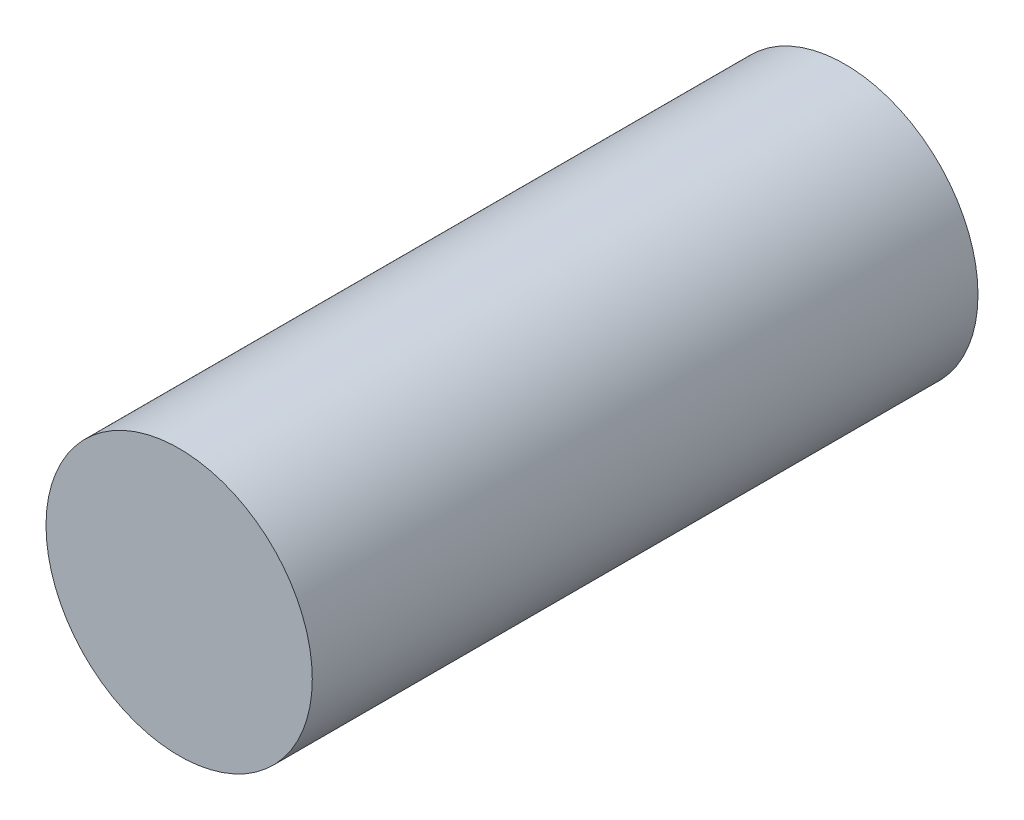
ISO-10303-21;
HEADER;
FILE_DESCRIPTION(('STEP AP214'),'2;1');
FILE_NAME('part.step','',(''),(''),'','','');
FILE_SCHEMA(('AUTOMOTIVE_DESIGN { 1 0 10303 214 1 1 1 1 }'));
ENDSEC;
DATA;
#1=APPLICATION_CONTEXT('core data for automotive mechanical design processes');
#2=APPLICATION_PROTOCOL_DEFINITION('international standard','automotive_design',2000,#1);
#3=PRODUCT_CONTEXT('',#1,'mechanical');
#4=PRODUCT('Part','Part','',(#3));
#5=PRODUCT_RELATED_PRODUCT_CATEGORY('part','',(#4));
#6=PRODUCT_DEFINITION_FORMATION('','',#4);
#7=PRODUCT_DEFINITION_CONTEXT('part definition',#1,'design');
#8=PRODUCT_DEFINITION('design','',#6,#7);
#9=PRODUCT_DEFINITION_SHAPE('','',#8);
#10=(LENGTH_UNIT() NAMED_UNIT(*) SI_UNIT(.MILLI.,.METRE.));
#11=(NAMED_UNIT(*) PLANE_ANGLE_UNIT() SI_UNIT($,.RADIAN.));
#12=(NAMED_UNIT(*) SI_UNIT($,.STERADIAN.) SOLID_ANGLE_UNIT());
#13=UNCERTAINTY_MEASURE_WITH_UNIT(LENGTH_MEASURE(1.E-05),#10,'distance_accuracy_value','');
#14=(GEOMETRIC_REPRESENTATION_CONTEXT(3) GLOBAL_UNCERTAINTY_ASSIGNED_CONTEXT((#13)) GLOBAL_UNIT_ASSIGNED_CONTEXT((#10,
#11,#12)) REPRESENTATION_CONTEXT('',''));
#15=CARTESIAN_POINT('',(0.,0.,0.));
#16=DIRECTION('',(0.,0.,1.));
#17=DIRECTION('',(1.,0.,0.));
#18=AXIS2_PLACEMENT_3D('',#15,#16,#17);
#19=CARTESIAN_POINT('',(0.,0.,5.));
#20=DIRECTION('',(0.,0.,-1.));
#21=DIRECTION('',(-1.,0.,0.));
#22=AXIS2_PLACEMENT_3D('',#19,#20,#21);
#23=CYLINDRICAL_SURFACE('',#22,1.);
#24=CARTESIAN_POINT('',(0.,0.,5.));
#25=DIRECTION('',(0.,0.,1.));
#26=DIRECTION('',(1.,0.,0.));
#27=AXIS2_PLACEMENT_3D('',#24,#25,#26);
#28=CIRCLE('',#27,1.);
#29=CARTESIAN_POINT('',(1.,0.,5.));
#30=VERTEX_POINT('',#29);
#31=EDGE_CURVE('E10',#30,#30,#28,.T.);
#32=ORIENTED_EDGE('',*,*,#31,.F.);
#33=EDGE_LOOP('',(#32));
#34=FACE_BOUND('',#33,.T.);
#35=CARTESIAN_POINT('',(0.,0.,0.));
#36=DIRECTION('',(0.,0.,1.));
#37=DIRECTION('',(1.,0.,0.));
#38=AXIS2_PLACEMENT_3D('',#35,#36,#37);
#39=CIRCLE('',#38,1.);
#40=CARTESIAN_POINT('',(1.,0.,0.));
#41=VERTEX_POINT('',#40);
#42=EDGE_CURVE('E34',#41,#41,#39,.T.);
#43=ORIENTED_EDGE('',*,*,#42,.T.);
#44=EDGE_LOOP('',(#43));
#45=FACE_BOUND('',#44,.T.);
#46=ADVANCED_FACE('F31',(#34,#45),#23,.T.);
#47=CARTESIAN_POINT('',(0.,0.,5.));
#48=DIRECTION('',(0.,0.,1.));
#49=DIRECTION('',(1.,0.,0.));
#50=AXIS2_PLACEMENT_3D('',#47,#48,#49);
#51=PLANE('',#50);
#52=ORIENTED_EDGE('',*,*,#31,.T.);
#53=EDGE_LOOP('',(#52));
#54=FACE_BOUND('',#53,.T.);
#55=ADVANCED_FACE('F46',(#54),#51,.T.);
#56=CARTESIAN_POINT('',(0.,0.,0.));
#57=DIRECTION('',(0.,0.,1.));
#58=DIRECTION('',(1.,0.,0.));
#59=AXIS2_PLACEMENT_3D('',#56,#57,#58);
#60=PLANE('',#59);
#61=ORIENTED_EDGE('',*,*,#42,.F.);
#62=EDGE_LOOP('',(#61));
#63=FACE_BOUND('',#62,.T.);
#64=ADVANCED_FACE('F44',(#63),#60,.F.);
#65=CLOSED_SHELL('',(#46,#55,#64));
#66=MANIFOLD_SOLID_BREP('B2',#65);
#67=ADVANCED_BREP_SHAPE_REPRESENTATION('',(#18,#66),#14);
#68=SHAPE_DEFINITION_REPRESENTATION(#9,#67);
ENDSEC;
END-ISO-10303-21;
